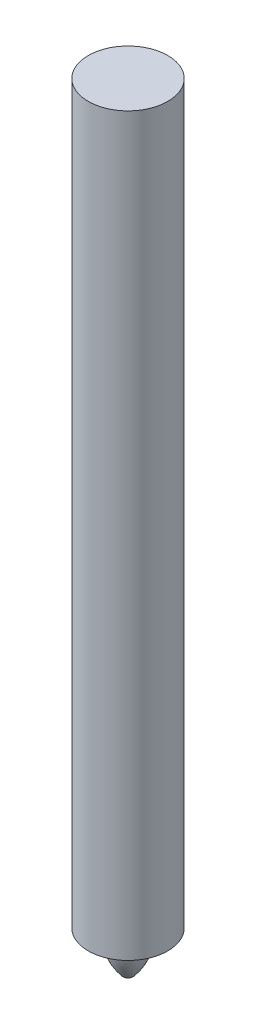
ISO-10303-21;
HEADER;
FILE_DESCRIPTION(('STEP AP214'),'2;1');
FILE_NAME('part.step','',(''),(''),'','','');
FILE_SCHEMA(('AUTOMOTIVE_DESIGN { 1 0 10303 214 1 1 1 1 }'));
ENDSEC;
DATA;
#1=APPLICATION_CONTEXT('core data for automotive mechanical design processes');
#2=APPLICATION_PROTOCOL_DEFINITION('international standard','automotive_design',2000,#1);
#3=PRODUCT_CONTEXT('',#1,'mechanical');
#4=PRODUCT('Part','Part','',(#3));
#5=PRODUCT_RELATED_PRODUCT_CATEGORY('part','',(#4));
#6=PRODUCT_DEFINITION_FORMATION('','',#4);
#7=PRODUCT_DEFINITION_CONTEXT('part definition',#1,'design');
#8=PRODUCT_DEFINITION('design','',#6,#7);
#9=PRODUCT_DEFINITION_SHAPE('','',#8);
#10=(LENGTH_UNIT() NAMED_UNIT(*) SI_UNIT(.MILLI.,.METRE.));
#11=(NAMED_UNIT(*) PLANE_ANGLE_UNIT() SI_UNIT($,.RADIAN.));
#12=(NAMED_UNIT(*) SI_UNIT($,.STERADIAN.) SOLID_ANGLE_UNIT());
#13=UNCERTAINTY_MEASURE_WITH_UNIT(LENGTH_MEASURE(1.E-05),#10,'distance_accuracy_value','');
#14=(GEOMETRIC_REPRESENTATION_CONTEXT(3) GLOBAL_UNCERTAINTY_ASSIGNED_CONTEXT((#13)) GLOBAL_UNIT_ASSIGNED_CONTEXT((#10,
#11,#12)) REPRESENTATION_CONTEXT('',''));
#15=CARTESIAN_POINT('',(0.,0.,0.));
#16=DIRECTION('',(0.,0.,1.));
#17=DIRECTION('',(1.,0.,0.));
#18=AXIS2_PLACEMENT_3D('',#15,#16,#17);
#19=CARTESIAN_POINT('',(0.,123.825,0.));
#20=DIRECTION('',(0.,1.,0.));
#21=DIRECTION('',(0.,0.,1.));
#22=AXIS2_PLACEMENT_3D('',#19,#20,#21);
#23=PLANE('',#22);
#24=CARTESIAN_POINT('',(0.,123.825,0.));
#25=DIRECTION('',(0.,-1.,0.));
#26=DIRECTION('',(0.,0.,-1.));
#27=AXIS2_PLACEMENT_3D('',#24,#25,#26);
#28=CIRCLE('',#27,6.34999999999999);
#29=CARTESIAN_POINT('',(0.,123.825,-6.34999999999999));
#30=VERTEX_POINT('',#29);
#31=EDGE_CURVE('E10',#30,#30,#28,.T.);
#32=ORIENTED_EDGE('',*,*,#31,.F.);
#33=EDGE_LOOP('',(#32));
#34=FACE_BOUND('',#33,.T.);
#35=ADVANCED_FACE('F39',(#34),#23,.T.);
#36=CARTESIAN_POINT('',(0.,0.,0.));
#37=DIRECTION('',(0.,-1.,0.));
#38=DIRECTION('',(0.,0.,-1.));
#39=AXIS2_PLACEMENT_3D('',#36,#37,#38);
#40=CYLINDRICAL_SURFACE('',#39,6.35);
#41=ORIENTED_EDGE('',*,*,#31,.T.);
#42=EDGE_LOOP('',(#41));
#43=FACE_BOUND('',#42,.T.);
#44=CARTESIAN_POINT('',(0.,6.35,0.));
#45=DIRECTION('',(0.,-1.,0.));
#46=DIRECTION('',(0.,0.,-1.));
#47=AXIS2_PLACEMENT_3D('',#44,#45,#46);
#48=CIRCLE('',#47,6.35000000000001);
#49=CARTESIAN_POINT('',(0.,6.35,-6.35000000000001));
#50=VERTEX_POINT('',#49);
#51=EDGE_CURVE('E46',#50,#50,#48,.T.);
#52=ORIENTED_EDGE('',*,*,#51,.F.);
#53=EDGE_LOOP('',(#52));
#54=FACE_BOUND('',#53,.T.);
#55=ADVANCED_FACE('F75',(#43,#54),#40,.T.);
#56=CARTESIAN_POINT('',(6.35000000000001,6.35,0.));
#57=DIRECTION('',(0.,-1.,0.));
#58=DIRECTION('',(0.,0.,-1.));
#59=AXIS2_PLACEMENT_3D('',#56,#57,#58);
#60=PLANE('',#59);
#61=ORIENTED_EDGE('',*,*,#51,.T.);
#62=EDGE_LOOP('',(#61));
#63=FACE_BOUND('',#62,.T.);
#64=CARTESIAN_POINT('',(0.,6.35,0.));
#65=DIRECTION('',(0.,-1.,0.));
#66=DIRECTION('',(0.,0.,-1.));
#67=AXIS2_PLACEMENT_3D('',#64,#65,#66);
#68=CIRCLE('',#67,3.175);
#69=CARTESIAN_POINT('',(0.,6.35,-3.175));
#70=VERTEX_POINT('',#69);
#71=EDGE_CURVE('E51',#70,#70,#68,.T.);
#72=ORIENTED_EDGE('',*,*,#71,.F.);
#73=EDGE_LOOP('',(#72));
#74=FACE_BOUND('',#73,.T.);
#75=ADVANCED_FACE('F67',(#63,#74),#60,.T.);
#76=CARTESIAN_POINT('',(0.,6.35,0.));
#77=DIRECTION('',(0.,-1.,0.));
#78=DIRECTION('',(0.,0.,-1.));
#79=AXIS2_PLACEMENT_3D('',#76,#77,#78);
#80=DEGENERATE_TOROIDAL_SURFACE('',#79,6.48229166666667,9.65729166666667,.F.);
#81=ORIENTED_EDGE('',*,*,#71,.T.);
#82=EDGE_LOOP('',(#81));
#83=FACE_BOUND('',#82,.T.);
#84=CARTESIAN_POINT('',(0.,0.,0.));
#85=DIRECTION('',(0.,-1.,0.));
#86=DIRECTION('',(0.,0.,-1.));
#87=AXIS2_PLACEMENT_3D('',#84,#85,#86);
#88=CIRCLE('',#87,0.79375);
#89=CARTESIAN_POINT('',(0.,0.,-0.79375));
#90=VERTEX_POINT('',#89);
#91=EDGE_CURVE('E56',#90,#90,#88,.T.);
#92=ORIENTED_EDGE('',*,*,#91,.F.);
#93=EDGE_LOOP('',(#92));
#94=FACE_BOUND('',#93,.T.);
#95=ADVANCED_FACE('F65',(#83,#94),#80,.F.);
#96=CARTESIAN_POINT('',(0.79375,0.,0.));
#97=DIRECTION('',(0.,-1.,0.));
#98=DIRECTION('',(0.,0.,-1.));
#99=AXIS2_PLACEMENT_3D('',#96,#97,#98);
#100=PLANE('',#99);
#101=ORIENTED_EDGE('',*,*,#91,.T.);
#102=EDGE_LOOP('',(#101));
#103=FACE_BOUND('',#102,.T.);
#104=ADVANCED_FACE('F63',(#103),#100,.T.);
#105=CLOSED_SHELL('',(#35,#55,#75,#95,#104));
#106=MANIFOLD_SOLID_BREP('B2',#105);
#107=ADVANCED_BREP_SHAPE_REPRESENTATION('',(#18,#106),#14);
#108=SHAPE_DEFINITION_REPRESENTATION(#9,#107);
ENDSEC;
END-ISO-10303-21;
